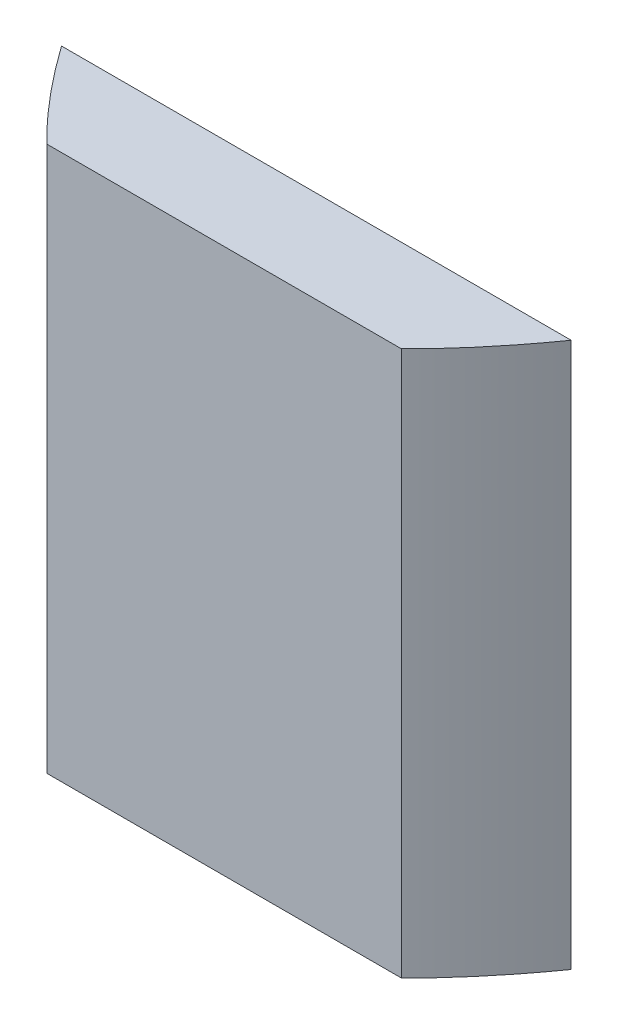
ISO-10303-21;
HEADER;
FILE_DESCRIPTION(('STEP AP214'),'2;1');
FILE_NAME('part.step','',(''),(''),'','','');
FILE_SCHEMA(('AUTOMOTIVE_DESIGN { 1 0 10303 214 1 1 1 1 }'));
ENDSEC;
DATA;
#1=APPLICATION_CONTEXT('core data for automotive mechanical design processes');
#2=APPLICATION_PROTOCOL_DEFINITION('international standard','automotive_design',2000,#1);
#3=PRODUCT_CONTEXT('',#1,'mechanical');
#4=PRODUCT('Part','Part','',(#3));
#5=PRODUCT_RELATED_PRODUCT_CATEGORY('part','',(#4));
#6=PRODUCT_DEFINITION_FORMATION('','',#4);
#7=PRODUCT_DEFINITION_CONTEXT('part definition',#1,'design');
#8=PRODUCT_DEFINITION('design','',#6,#7);
#9=PRODUCT_DEFINITION_SHAPE('','',#8);
#10=(LENGTH_UNIT() NAMED_UNIT(*) SI_UNIT(.MILLI.,.METRE.));
#11=(NAMED_UNIT(*) PLANE_ANGLE_UNIT() SI_UNIT($,.RADIAN.));
#12=(NAMED_UNIT(*) SI_UNIT($,.STERADIAN.) SOLID_ANGLE_UNIT());
#13=UNCERTAINTY_MEASURE_WITH_UNIT(LENGTH_MEASURE(1.E-05),#10,'distance_accuracy_value','');
#14=(GEOMETRIC_REPRESENTATION_CONTEXT(3) GLOBAL_UNCERTAINTY_ASSIGNED_CONTEXT((#13)) GLOBAL_UNIT_ASSIGNED_CONTEXT((#10,
#11,#12)) REPRESENTATION_CONTEXT('',''));
#15=CARTESIAN_POINT('',(0.,0.,0.));
#16=DIRECTION('',(0.,0.,1.));
#17=DIRECTION('',(1.,0.,0.));
#18=AXIS2_PLACEMENT_3D('',#15,#16,#17);
#19=CARTESIAN_POINT('',(-200.000000000337,300.,-6.70196537155832E-10));
#20=CARTESIAN_POINT('',(-5.91540705308091E-11,300.,400.000000000552));
#21=CARTESIAN_POINT('',(200.000000000219,300.,-4.34305369445553E-10));
#22=B_SPLINE_CURVE_WITH_KNOTS('',2,(#19,#20,#21),.UNSPECIFIED.,.F.,.F.,(3,3),(0.056028396232078,
0.943971603767659),.UNSPECIFIED.);
#23=DIRECTION('',(0.,-1.,0.));
#24=VECTOR('',#23,1.);
#25=SURFACE_OF_LINEAR_EXTRUSION('',#22,#24);
#26=CARTESIAN_POINT('',(-200.000000000337,0.,-6.70196537155832E-10));
#27=CARTESIAN_POINT('',(-5.91540705308091E-11,0.,400.000000000552));
#28=CARTESIAN_POINT('',(200.000000000219,0.,-4.34305369445553E-10));
#29=B_SPLINE_CURVE_WITH_KNOTS('',2,(#26,#27,#28),.UNSPECIFIED.,.F.,.F.,(3,3),(0.056028396232078,
0.943971603767659),.UNSPECIFIED.);
#30=CARTESIAN_POINT('',(-140.285423334378,0.,101.599999999465));
#31=VERTEX_POINT('',#30);
#32=CARTESIAN_POINT('',(-97.5704873417419,0.,152.399999999476));
#33=VERTEX_POINT('',#32);
#34=EDGE_CURVE('E89',#31,#33,#29,.T.);
#35=ORIENTED_EDGE('',*,*,#34,.T.);
#36=DIRECTION('',(0.,-1.,0.));
#37=VECTOR('',#36,1.);
#38=CARTESIAN_POINT('',(-97.5704873417535,300.,152.399999999465));
#39=LINE('',#38,#37);
#40=CARTESIAN_POINT('',(-97.5704873417419,300.,152.399999999465));
#41=VERTEX_POINT('',#40);
#42=EDGE_CURVE('E48',#33,#41,#39,.F.);
#43=ORIENTED_EDGE('',*,*,#42,.T.);
#44=CARTESIAN_POINT('',(-140.285423334378,300.,101.599999999465));
#45=VERTEX_POINT('',#44);
#46=EDGE_CURVE('E86',#45,#41,#22,.T.);
#47=ORIENTED_EDGE('',*,*,#46,.F.);
#48=DIRECTION('',(0.,-1.,0.));
#49=VECTOR('',#48,1.);
#50=CARTESIAN_POINT('',(-140.285423334385,300.,101.599999999465));
#51=LINE('',#50,#49);
#52=EDGE_CURVE('E96',#45,#31,#51,.T.);
#53=ORIENTED_EDGE('',*,*,#52,.T.);
#54=EDGE_LOOP('',(#35,#43,#47,#53));
#55=FACE_BOUND('',#54,.T.);
#56=ADVANCED_FACE('F33',(#55),#25,.F.);
#57=CARTESIAN_POINT('',(97.5704873417415,300.,152.399999999465));
#58=VERTEX_POINT('',#57);
#59=CARTESIAN_POINT('',(140.285423334378,300.,101.599999999465));
#60=VERTEX_POINT('',#59);
#61=EDGE_CURVE('E83',#58,#60,#22,.T.);
#62=ORIENTED_EDGE('',*,*,#61,.F.);
#63=DIRECTION('',(0.,-1.,0.));
#64=VECTOR('',#63,1.);
#65=CARTESIAN_POINT('',(97.5704873417532,300.,152.399999999465));
#66=LINE('',#65,#64);
#67=CARTESIAN_POINT('',(97.5704873417416,0.,152.399999999465));
#68=VERTEX_POINT('',#67);
#69=EDGE_CURVE('E73',#58,#68,#66,.T.);
#70=ORIENTED_EDGE('',*,*,#69,.T.);
#71=CARTESIAN_POINT('',(140.285423334378,0.,101.599999999474));
#72=VERTEX_POINT('',#71);
#73=EDGE_CURVE('E56',#68,#72,#29,.T.);
#74=ORIENTED_EDGE('',*,*,#73,.T.);
#75=DIRECTION('',(0.,-1.,0.));
#76=VECTOR('',#75,1.);
#77=CARTESIAN_POINT('',(140.285423334384,300.,101.599999999465));
#78=LINE('',#77,#76);
#79=EDGE_CURVE('E88',#72,#60,#78,.F.);
#80=ORIENTED_EDGE('',*,*,#79,.T.);
#81=EDGE_LOOP('',(#62,#70,#74,#80));
#82=FACE_BOUND('',#81,.T.);
#83=ADVANCED_FACE('F35',(#82),#25,.F.);
#84=CARTESIAN_POINT('',(-5.9161009424713E-11,300.,200.));
#85=DIRECTION('',(0.,-1.,0.));
#86=DIRECTION('',(0.,0.,-1.));
#87=AXIS2_PLACEMENT_3D('',#84,#85,#86);
#88=PLANE('',#87);
#89=ORIENTED_EDGE('',*,*,#46,.T.);
#90=DIRECTION('',(-1.,0.,0.));
#91=VECTOR('',#90,1.);
#92=CARTESIAN_POINT('',(-234.45939795616,300.,152.399999999465));
#93=LINE('',#92,#91);
#94=EDGE_CURVE('E76',#58,#41,#93,.T.);
#95=ORIENTED_EDGE('',*,*,#94,.F.);
#96=ORIENTED_EDGE('',*,*,#61,.T.);
#97=DIRECTION('',(1.,0.,0.));
#98=VECTOR('',#97,1.);
#99=CARTESIAN_POINT('',(-242.001138287766,300.,101.599999999465));
#100=LINE('',#99,#98);
#101=EDGE_CURVE('E159',#45,#60,#100,.T.);
#102=ORIENTED_EDGE('',*,*,#101,.F.);
#103=EDGE_LOOP('',(#89,#95,#96,#102));
#104=FACE_BOUND('',#103,.T.);
#105=ADVANCED_FACE('F81',(#104),#88,.F.);
#106=CARTESIAN_POINT('',(-5.9161009424713E-11,0.,200.));
#107=DIRECTION('',(0.,-1.,0.));
#108=DIRECTION('',(0.,0.,-1.));
#109=AXIS2_PLACEMENT_3D('',#106,#107,#108);
#110=PLANE('',#109);
#111=DIRECTION('',(1.,0.,0.));
#112=VECTOR('',#111,1.);
#113=CARTESIAN_POINT('',(-5.9161009424713E-11,0.,152.399999999465));
#114=LINE('',#113,#112);
#115=EDGE_CURVE('E11',#33,#68,#114,.T.);
#116=ORIENTED_EDGE('',*,*,#115,.F.);
#117=ORIENTED_EDGE('',*,*,#34,.F.);
#118=DIRECTION('',(-1.,0.,0.));
#119=VECTOR('',#118,1.);
#120=CARTESIAN_POINT('',(-5.9161009424713E-11,0.,101.599999999465));
#121=LINE('',#120,#119);
#122=EDGE_CURVE('E42',#72,#31,#121,.T.);
#123=ORIENTED_EDGE('',*,*,#122,.F.);
#124=ORIENTED_EDGE('',*,*,#73,.F.);
#125=EDGE_LOOP('',(#116,#117,#123,#124));
#126=FACE_BOUND('',#125,.T.);
#127=ADVANCED_FACE('F113',(#126),#110,.T.);
#128=CARTESIAN_POINT('',(-242.001138287766,-50.,101.599999999465));
#129=DIRECTION('',(0.,0.,1.));
#130=DIRECTION('',(1.,0.,0.));
#131=AXIS2_PLACEMENT_3D('',#128,#129,#130);
#132=PLANE('',#131);
#133=ORIENTED_EDGE('',*,*,#101,.T.);
#134=ORIENTED_EDGE('',*,*,#79,.F.);
#135=ORIENTED_EDGE('',*,*,#122,.T.);
#136=ORIENTED_EDGE('',*,*,#52,.F.);
#137=EDGE_LOOP('',(#133,#134,#135,#136));
#138=FACE_BOUND('',#137,.T.);
#139=ADVANCED_FACE('F109',(#138),#132,.F.);
#140=CARTESIAN_POINT('',(-234.45939795616,-50.,152.399999999465));
#141=DIRECTION('',(0.,0.,-1.));
#142=DIRECTION('',(-1.,0.,0.));
#143=AXIS2_PLACEMENT_3D('',#140,#141,#142);
#144=PLANE('',#143);
#145=ORIENTED_EDGE('',*,*,#115,.T.);
#146=ORIENTED_EDGE('',*,*,#69,.F.);
#147=ORIENTED_EDGE('',*,*,#94,.T.);
#148=ORIENTED_EDGE('',*,*,#42,.F.);
#149=EDGE_LOOP('',(#145,#146,#147,#148));
#150=FACE_BOUND('',#149,.T.);
#151=ADVANCED_FACE('F75',(#150),#144,.F.);
#152=CLOSED_SHELL('',(#56,#83,#105,#127,#139,#151));
#153=MANIFOLD_SOLID_BREP('B2',#152);
#154=ADVANCED_BREP_SHAPE_REPRESENTATION('',(#18,#153),#14);
#155=SHAPE_DEFINITION_REPRESENTATION(#9,#154);
ENDSEC;
END-ISO-10303-21;
